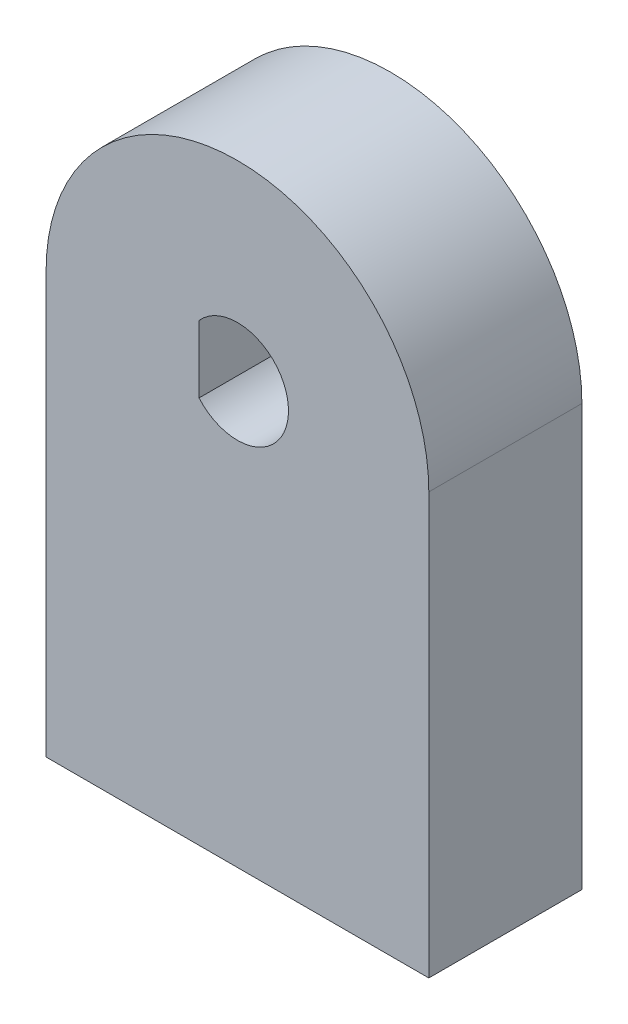
ISO-10303-21;
HEADER;
FILE_DESCRIPTION(('STEP AP214'),'2;1');
FILE_NAME('part.step','',(''),(''),'','','');
FILE_SCHEMA(('AUTOMOTIVE_DESIGN { 1 0 10303 214 1 1 1 1 }'));
ENDSEC;
DATA;
#1=APPLICATION_CONTEXT('core data for automotive mechanical design processes');
#2=APPLICATION_PROTOCOL_DEFINITION('international standard','automotive_design',2000,#1);
#3=PRODUCT_CONTEXT('',#1,'mechanical');
#4=PRODUCT('Part','Part','',(#3));
#5=PRODUCT_RELATED_PRODUCT_CATEGORY('part','',(#4));
#6=PRODUCT_DEFINITION_FORMATION('','',#4);
#7=PRODUCT_DEFINITION_CONTEXT('part definition',#1,'design');
#8=PRODUCT_DEFINITION('design','',#6,#7);
#9=PRODUCT_DEFINITION_SHAPE('','',#8);
#10=(LENGTH_UNIT() NAMED_UNIT(*) SI_UNIT(.MILLI.,.METRE.));
#11=(NAMED_UNIT(*) PLANE_ANGLE_UNIT() SI_UNIT($,.RADIAN.));
#12=(NAMED_UNIT(*) SI_UNIT($,.STERADIAN.) SOLID_ANGLE_UNIT());
#13=UNCERTAINTY_MEASURE_WITH_UNIT(LENGTH_MEASURE(1.E-05),#10,'distance_accuracy_value','');
#14=(GEOMETRIC_REPRESENTATION_CONTEXT(3) GLOBAL_UNCERTAINTY_ASSIGNED_CONTEXT((#13)) GLOBAL_UNIT_ASSIGNED_CONTEXT((#10,
#11,#12)) REPRESENTATION_CONTEXT('',''));
#15=CARTESIAN_POINT('',(0.,0.,0.));
#16=DIRECTION('',(0.,0.,1.));
#17=DIRECTION('',(1.,0.,0.));
#18=AXIS2_PLACEMENT_3D('',#15,#16,#17);
#19=CARTESIAN_POINT('',(0.,0.,0.));
#20=DIRECTION('',(0.,0.,1.));
#21=DIRECTION('',(1.,0.,0.));
#22=AXIS2_PLACEMENT_3D('',#19,#20,#21);
#23=PLANE('',#22);
#24=CARTESIAN_POINT('',(0.,0.,0.));
#25=DIRECTION('',(0.,0.,1.));
#26=DIRECTION('',(1.,0.,0.));
#27=AXIS2_PLACEMENT_3D('',#24,#25,#26);
#28=CIRCLE('',#27,15.);
#29=CARTESIAN_POINT('',(15.,0.,0.));
#30=VERTEX_POINT('',#29);
#31=CARTESIAN_POINT('',(-15.,0.,0.));
#32=VERTEX_POINT('',#31);
#33=EDGE_CURVE('E11',#30,#32,#28,.T.);
#34=ORIENTED_EDGE('',*,*,#33,.F.);
#35=DIRECTION('',(0.,1.,0.));
#36=VECTOR('',#35,1.);
#37=CARTESIAN_POINT('',(15.,0.,0.));
#38=LINE('',#37,#36);
#39=CARTESIAN_POINT('',(15.,-33.,0.));
#40=VERTEX_POINT('',#39);
#41=EDGE_CURVE('E131',#40,#30,#38,.T.);
#42=ORIENTED_EDGE('',*,*,#41,.F.);
#43=DIRECTION('',(1.,0.,0.));
#44=VECTOR('',#43,1.);
#45=CARTESIAN_POINT('',(15.,-33.,0.));
#46=LINE('',#45,#44);
#47=CARTESIAN_POINT('',(-15.,-33.,0.));
#48=VERTEX_POINT('',#47);
#49=EDGE_CURVE('E126',#48,#40,#46,.T.);
#50=ORIENTED_EDGE('',*,*,#49,.F.);
#51=DIRECTION('',(0.,-1.,0.));
#52=VECTOR('',#51,1.);
#53=CARTESIAN_POINT('',(-15.,0.,0.));
#54=LINE('',#53,#52);
#55=EDGE_CURVE('E122',#32,#48,#54,.T.);
#56=ORIENTED_EDGE('',*,*,#55,.F.);
#57=EDGE_LOOP('',(#34,#42,#50,#56));
#58=FACE_BOUND('',#57,.T.);
#59=CARTESIAN_POINT('',(0.,0.,0.));
#60=DIRECTION('',(0.,0.,1.));
#61=DIRECTION('',(1.,0.,0.));
#62=AXIS2_PLACEMENT_3D('',#59,#60,#61);
#63=CIRCLE('',#62,11.);
#64=CARTESIAN_POINT('',(11.,0.,0.));
#65=VERTEX_POINT('',#64);
#66=EDGE_CURVE('E49',#65,#65,#63,.T.);
#67=ORIENTED_EDGE('',*,*,#66,.T.);
#68=EDGE_LOOP('',(#67));
#69=FACE_BOUND('',#68,.T.);
#70=ADVANCED_FACE('F40',(#58,#69),#23,.F.);
#71=CARTESIAN_POINT('',(0.,0.,4.));
#72=DIRECTION('',(0.,0.,-1.));
#73=DIRECTION('',(-1.,0.,0.));
#74=AXIS2_PLACEMENT_3D('',#71,#72,#73);
#75=CYLINDRICAL_SURFACE('',#74,15.);
#76=CARTESIAN_POINT('',(0.,0.,12.));
#77=DIRECTION('',(0.,0.,1.));
#78=DIRECTION('',(1.,0.,0.));
#79=AXIS2_PLACEMENT_3D('',#76,#77,#78);
#80=CIRCLE('',#79,15.);
#81=CARTESIAN_POINT('',(15.,0.,12.));
#82=VERTEX_POINT('',#81);
#83=CARTESIAN_POINT('',(-15.,0.,12.));
#84=VERTEX_POINT('',#83);
#85=EDGE_CURVE('E97',#82,#84,#80,.T.);
#86=ORIENTED_EDGE('',*,*,#85,.F.);
#87=DIRECTION('',(0.,0.,1.));
#88=VECTOR('',#87,1.);
#89=CARTESIAN_POINT('',(15.,0.,0.));
#90=LINE('',#89,#88);
#91=EDGE_CURVE('E144',#30,#82,#90,.T.);
#92=ORIENTED_EDGE('',*,*,#91,.F.);
#93=ORIENTED_EDGE('',*,*,#33,.T.);
#94=DIRECTION('',(0.,0.,1.));
#95=VECTOR('',#94,1.);
#96=CARTESIAN_POINT('',(-15.,0.,0.));
#97=LINE('',#96,#95);
#98=EDGE_CURVE('E134',#32,#84,#97,.T.);
#99=ORIENTED_EDGE('',*,*,#98,.T.);
#100=EDGE_LOOP('',(#86,#92,#93,#99));
#101=FACE_BOUND('',#100,.T.);
#102=ADVANCED_FACE('F42',(#101),#75,.T.);
#103=CARTESIAN_POINT('',(0.,0.,4.));
#104=DIRECTION('',(0.,0.,-1.));
#105=DIRECTION('',(-1.,0.,0.));
#106=AXIS2_PLACEMENT_3D('',#103,#104,#105);
#107=CYLINDRICAL_SURFACE('',#106,11.);
#108=CARTESIAN_POINT('',(0.,0.,4.));
#109=DIRECTION('',(0.,0.,1.));
#110=DIRECTION('',(1.,0.,0.));
#111=AXIS2_PLACEMENT_3D('',#108,#109,#110);
#112=CIRCLE('',#111,11.);
#113=CARTESIAN_POINT('',(11.,0.,4.));
#114=VERTEX_POINT('',#113);
#115=EDGE_CURVE('E162',#114,#114,#112,.T.);
#116=ORIENTED_EDGE('',*,*,#115,.T.);
#117=EDGE_LOOP('',(#116));
#118=FACE_BOUND('',#117,.T.);
#119=ORIENTED_EDGE('',*,*,#66,.F.);
#120=EDGE_LOOP('',(#119));
#121=FACE_BOUND('',#120,.T.);
#122=ADVANCED_FACE('F170',(#118,#121),#107,.F.);
#123=CARTESIAN_POINT('',(0.,0.,4.));
#124=DIRECTION('',(0.,0.,1.));
#125=DIRECTION('',(1.,0.,0.));
#126=AXIS2_PLACEMENT_3D('',#123,#124,#125);
#127=PLANE('',#126);
#128=CARTESIAN_POINT('',(0.,0.,4.));
#129=DIRECTION('',(0.,0.,1.));
#130=DIRECTION('',(1.,0.,0.));
#131=AXIS2_PLACEMENT_3D('',#128,#129,#130);
#132=CIRCLE('',#131,4.);
#133=CARTESIAN_POINT('',(-3.0138181763338,-2.63,4.));
#134=VERTEX_POINT('',#133);
#135=CARTESIAN_POINT('',(-3.0138181763338,2.63,4.));
#136=VERTEX_POINT('',#135);
#137=EDGE_CURVE('E56',#134,#136,#132,.T.);
#138=ORIENTED_EDGE('',*,*,#137,.T.);
#139=DIRECTION('',(0.,1.,0.));
#140=VECTOR('',#139,1.);
#141=CARTESIAN_POINT('',(-3.0138181763338,2.63,4.));
#142=LINE('',#141,#140);
#143=EDGE_CURVE('E105',#134,#136,#142,.T.);
#144=ORIENTED_EDGE('',*,*,#143,.F.);
#145=EDGE_LOOP('',(#138,#144));
#146=FACE_BOUND('',#145,.T.);
#147=ORIENTED_EDGE('',*,*,#115,.F.);
#148=EDGE_LOOP('',(#147));
#149=FACE_BOUND('',#148,.T.);
#150=ADVANCED_FACE('F172',(#146,#149),#127,.F.);
#151=CARTESIAN_POINT('',(0.,0.,12.));
#152=DIRECTION('',(0.,0.,1.));
#153=DIRECTION('',(1.,0.,0.));
#154=AXIS2_PLACEMENT_3D('',#151,#152,#153);
#155=PLANE('',#154);
#156=ORIENTED_EDGE('',*,*,#85,.T.);
#157=DIRECTION('',(0.,-1.,0.));
#158=VECTOR('',#157,1.);
#159=CARTESIAN_POINT('',(-15.,0.,12.));
#160=LINE('',#159,#158);
#161=CARTESIAN_POINT('',(-15.,-33.,12.));
#162=VERTEX_POINT('',#161);
#163=EDGE_CURVE('E120',#84,#162,#160,.T.);
#164=ORIENTED_EDGE('',*,*,#163,.T.);
#165=DIRECTION('',(1.,0.,0.));
#166=VECTOR('',#165,1.);
#167=CARTESIAN_POINT('',(15.,-33.,12.));
#168=LINE('',#167,#166);
#169=CARTESIAN_POINT('',(15.,-33.,12.));
#170=VERTEX_POINT('',#169);
#171=EDGE_CURVE('E138',#162,#170,#168,.T.);
#172=ORIENTED_EDGE('',*,*,#171,.T.);
#173=DIRECTION('',(0.,1.,0.));
#174=VECTOR('',#173,1.);
#175=CARTESIAN_POINT('',(15.,0.,12.));
#176=LINE('',#175,#174);
#177=EDGE_CURVE('E127',#170,#82,#176,.T.);
#178=ORIENTED_EDGE('',*,*,#177,.T.);
#179=EDGE_LOOP('',(#156,#164,#172,#178));
#180=FACE_BOUND('',#179,.T.);
#181=CARTESIAN_POINT('',(0.,0.,12.));
#182=DIRECTION('',(0.,0.,1.));
#183=DIRECTION('',(1.,0.,0.));
#184=AXIS2_PLACEMENT_3D('',#181,#182,#183);
#185=CIRCLE('',#184,4.);
#186=CARTESIAN_POINT('',(-3.0138181763338,-2.63,12.));
#187=VERTEX_POINT('',#186);
#188=CARTESIAN_POINT('',(-3.0138181763338,2.63,12.));
#189=VERTEX_POINT('',#188);
#190=EDGE_CURVE('E92',#187,#189,#185,.T.);
#191=ORIENTED_EDGE('',*,*,#190,.F.);
#192=DIRECTION('',(0.,1.,0.));
#193=VECTOR('',#192,1.);
#194=CARTESIAN_POINT('',(-3.0138181763338,2.63,12.));
#195=LINE('',#194,#193);
#196=EDGE_CURVE('E95',#187,#189,#195,.T.);
#197=ORIENTED_EDGE('',*,*,#196,.T.);
#198=EDGE_LOOP('',(#191,#197));
#199=FACE_BOUND('',#198,.T.);
#200=ADVANCED_FACE('F93',(#180,#199),#155,.T.);
#201=CARTESIAN_POINT('',(0.,0.,12.));
#202=DIRECTION('',(0.,0.,-1.));
#203=DIRECTION('',(-1.,0.,0.));
#204=AXIS2_PLACEMENT_3D('',#201,#202,#203);
#205=CYLINDRICAL_SURFACE('',#204,4.);
#206=DIRECTION('',(0.,0.,1.));
#207=VECTOR('',#206,1.);
#208=CARTESIAN_POINT('',(-3.0138181763338,-2.63,4.));
#209=LINE('',#208,#207);
#210=EDGE_CURVE('E99',#134,#187,#209,.T.);
#211=ORIENTED_EDGE('',*,*,#210,.T.);
#212=ORIENTED_EDGE('',*,*,#190,.T.);
#213=DIRECTION('',(0.,0.,1.));
#214=VECTOR('',#213,1.);
#215=CARTESIAN_POINT('',(-3.0138181763338,2.63,4.));
#216=LINE('',#215,#214);
#217=EDGE_CURVE('E61',#136,#189,#216,.T.);
#218=ORIENTED_EDGE('',*,*,#217,.F.);
#219=ORIENTED_EDGE('',*,*,#137,.F.);
#220=EDGE_LOOP('',(#211,#212,#218,#219));
#221=FACE_BOUND('',#220,.T.);
#222=ADVANCED_FACE('F100',(#221),#205,.F.);
#223=CARTESIAN_POINT('',(15.,0.,0.));
#224=DIRECTION('',(1.,0.,0.));
#225=DIRECTION('',(0.,1.,0.));
#226=AXIS2_PLACEMENT_3D('',#223,#224,#225);
#227=PLANE('',#226);
#228=ORIENTED_EDGE('',*,*,#177,.F.);
#229=DIRECTION('',(0.,0.,1.));
#230=VECTOR('',#229,1.);
#231=CARTESIAN_POINT('',(15.,-33.,0.));
#232=LINE('',#231,#230);
#233=EDGE_CURVE('E148',#40,#170,#232,.T.);
#234=ORIENTED_EDGE('',*,*,#233,.F.);
#235=ORIENTED_EDGE('',*,*,#41,.T.);
#236=ORIENTED_EDGE('',*,*,#91,.T.);
#237=EDGE_LOOP('',(#228,#234,#235,#236));
#238=FACE_BOUND('',#237,.T.);
#239=ADVANCED_FACE('F194',(#238),#227,.T.);
#240=CARTESIAN_POINT('',(15.,-33.,0.));
#241=DIRECTION('',(0.,-1.,0.));
#242=DIRECTION('',(1.,0.,0.));
#243=AXIS2_PLACEMENT_3D('',#240,#241,#242);
#244=PLANE('',#243);
#245=CARTESIAN_POINT('',(-6.99999999999999,-33.,6.));
#246=DIRECTION('',(0.,-1.,0.));
#247=DIRECTION('',(1.,0.,0.));
#248=AXIS2_PLACEMENT_3D('',#245,#246,#247);
#249=CIRCLE('',#248,2.875);
#250=CARTESIAN_POINT('',(-4.12499999999999,-33.,6.));
#251=VERTEX_POINT('',#250);
#252=EDGE_CURVE('E115',#251,#251,#249,.T.);
#253=ORIENTED_EDGE('',*,*,#252,.F.);
#254=EDGE_LOOP('',(#253));
#255=FACE_BOUND('',#254,.T.);
#256=CARTESIAN_POINT('',(7.,-33.,6.));
#257=DIRECTION('',(0.,-1.,0.));
#258=DIRECTION('',(1.,0.,0.));
#259=AXIS2_PLACEMENT_3D('',#256,#257,#258);
#260=CIRCLE('',#259,2.875);
#261=CARTESIAN_POINT('',(9.875,-33.,6.));
#262=VERTEX_POINT('',#261);
#263=EDGE_CURVE('E243',#262,#262,#260,.T.);
#264=ORIENTED_EDGE('',*,*,#263,.F.);
#265=EDGE_LOOP('',(#264));
#266=FACE_BOUND('',#265,.T.);
#267=ORIENTED_EDGE('',*,*,#171,.F.);
#268=DIRECTION('',(0.,0.,1.));
#269=VECTOR('',#268,1.);
#270=CARTESIAN_POINT('',(-15.,-33.,0.));
#271=LINE('',#270,#269);
#272=EDGE_CURVE('E151',#48,#162,#271,.T.);
#273=ORIENTED_EDGE('',*,*,#272,.F.);
#274=ORIENTED_EDGE('',*,*,#49,.T.);
#275=ORIENTED_EDGE('',*,*,#233,.T.);
#276=EDGE_LOOP('',(#267,#273,#274,#275));
#277=FACE_BOUND('',#276,.T.);
#278=ADVANCED_FACE('F197',(#255,#266,#277),#244,.T.);
#279=CARTESIAN_POINT('',(-15.,0.,0.));
#280=DIRECTION('',(-1.,0.,0.));
#281=DIRECTION('',(0.,-1.,0.));
#282=AXIS2_PLACEMENT_3D('',#279,#280,#281);
#283=PLANE('',#282);
#284=ORIENTED_EDGE('',*,*,#163,.F.);
#285=ORIENTED_EDGE('',*,*,#98,.F.);
#286=ORIENTED_EDGE('',*,*,#55,.T.);
#287=ORIENTED_EDGE('',*,*,#272,.T.);
#288=EDGE_LOOP('',(#284,#285,#286,#287));
#289=FACE_BOUND('',#288,.T.);
#290=ADVANCED_FACE('F199',(#289),#283,.T.);
#291=CARTESIAN_POINT('',(-3.0138181763338,2.63,4.));
#292=DIRECTION('',(1.,0.,0.));
#293=DIRECTION('',(0.,0.,-1.));
#294=AXIS2_PLACEMENT_3D('',#291,#292,#293);
#295=PLANE('',#294);
#296=ORIENTED_EDGE('',*,*,#196,.F.);
#297=ORIENTED_EDGE('',*,*,#210,.F.);
#298=ORIENTED_EDGE('',*,*,#143,.T.);
#299=ORIENTED_EDGE('',*,*,#217,.T.);
#300=EDGE_LOOP('',(#296,#297,#298,#299));
#301=FACE_BOUND('',#300,.T.);
#302=ADVANCED_FACE('F107',(#301),#295,.T.);
#303=CARTESIAN_POINT('',(7.,-19.,6.));
#304=DIRECTION('',(0.,-1.,0.));
#305=DIRECTION('',(1.,0.,0.));
#306=AXIS2_PLACEMENT_3D('',#303,#304,#305);
#307=CYLINDRICAL_SURFACE('',#306,2.875);
#308=CARTESIAN_POINT('',(7.,-19.,6.));
#309=DIRECTION('',(0.,-1.,0.));
#310=DIRECTION('',(1.,0.,0.));
#311=AXIS2_PLACEMENT_3D('',#308,#309,#310);
#312=CIRCLE('',#311,2.875);
#313=CARTESIAN_POINT('',(9.875,-19.,6.));
#314=VERTEX_POINT('',#313);
#315=EDGE_CURVE('E239',#314,#314,#312,.T.);
#316=ORIENTED_EDGE('',*,*,#315,.F.);
#317=EDGE_LOOP('',(#316));
#318=FACE_BOUND('',#317,.T.);
#319=ORIENTED_EDGE('',*,*,#263,.T.);
#320=EDGE_LOOP('',(#319));
#321=FACE_BOUND('',#320,.T.);
#322=ADVANCED_FACE('F217',(#318,#321),#307,.F.);
#323=CARTESIAN_POINT('',(7.,-19.,6.));
#324=DIRECTION('',(0.,-1.,0.));
#325=DIRECTION('',(1.,0.,0.));
#326=AXIS2_PLACEMENT_3D('',#323,#324,#325);
#327=PLANE('',#326);
#328=ORIENTED_EDGE('',*,*,#315,.T.);
#329=EDGE_LOOP('',(#328));
#330=FACE_BOUND('',#329,.T.);
#331=ADVANCED_FACE('F220',(#330),#327,.T.);
#332=CARTESIAN_POINT('',(-7.,-19.,6.));
#333=DIRECTION('',(0.,-1.,0.));
#334=DIRECTION('',(1.,0.,0.));
#335=AXIS2_PLACEMENT_3D('',#332,#333,#334);
#336=CYLINDRICAL_SURFACE('',#335,2.875);
#337=CARTESIAN_POINT('',(-7.,-19.,6.));
#338=DIRECTION('',(0.,-1.,0.));
#339=DIRECTION('',(1.,0.,0.));
#340=AXIS2_PLACEMENT_3D('',#337,#338,#339);
#341=CIRCLE('',#340,2.875);
#342=CARTESIAN_POINT('',(-4.125,-19.,6.));
#343=VERTEX_POINT('',#342);
#344=EDGE_CURVE('E109',#343,#343,#341,.T.);
#345=ORIENTED_EDGE('',*,*,#344,.F.);
#346=EDGE_LOOP('',(#345));
#347=FACE_BOUND('',#346,.T.);
#348=ORIENTED_EDGE('',*,*,#252,.T.);
#349=EDGE_LOOP('',(#348));
#350=FACE_BOUND('',#349,.T.);
#351=ADVANCED_FACE('F224',(#347,#350),#336,.F.);
#352=CARTESIAN_POINT('',(-7.,-19.,6.));
#353=DIRECTION('',(0.,-1.,0.));
#354=DIRECTION('',(1.,0.,0.));
#355=AXIS2_PLACEMENT_3D('',#352,#353,#354);
#356=PLANE('',#355);
#357=ORIENTED_EDGE('',*,*,#344,.T.);
#358=EDGE_LOOP('',(#357));
#359=FACE_BOUND('',#358,.T.);
#360=ADVANCED_FACE('F228',(#359),#356,.T.);
#361=CLOSED_SHELL('',(#70,#102,#122,#150,#200,#222,#239,#278,#290,#302,#322,#331,#351,#360));
#362=MANIFOLD_SOLID_BREP('B2',#361);
#363=ADVANCED_BREP_SHAPE_REPRESENTATION('',(#18,#362),#14);
#364=SHAPE_DEFINITION_REPRESENTATION(#9,#363);
ENDSEC;
END-ISO-10303-21;
